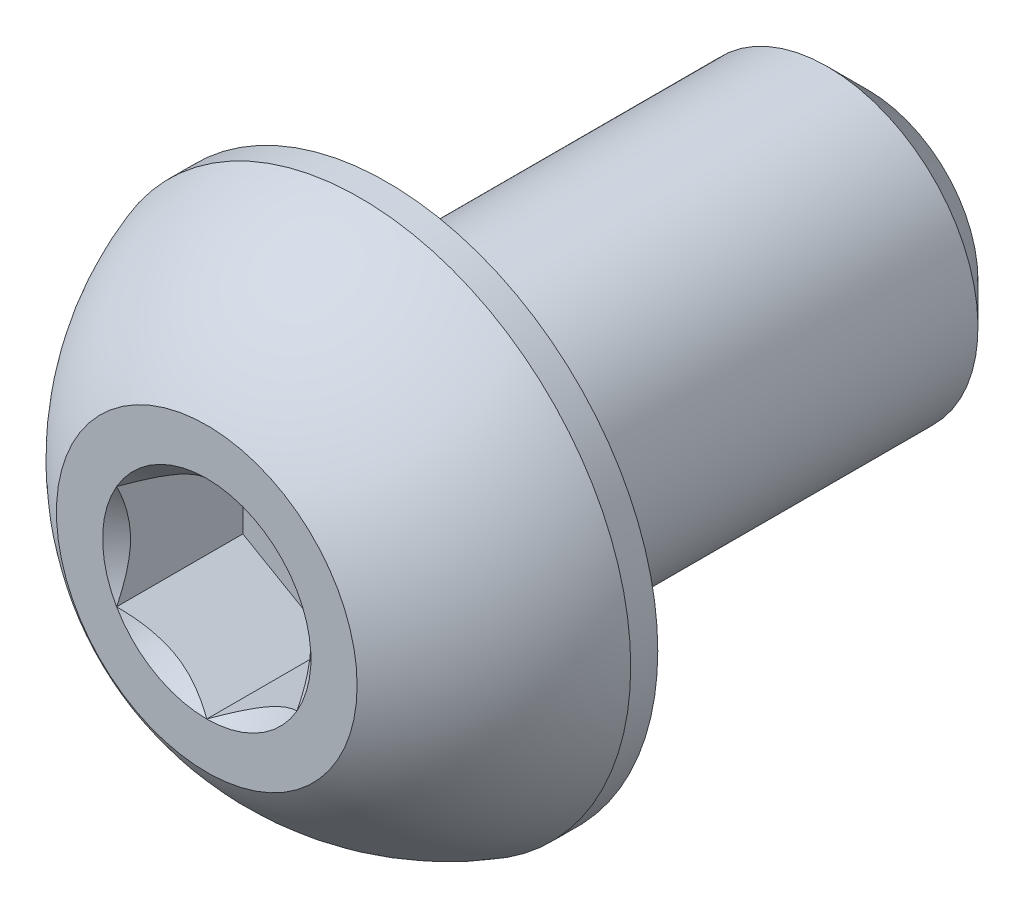
ISO-10303-21;
HEADER;
FILE_DESCRIPTION(('STEP AP214'),'2;1');
FILE_NAME('part.step','',(''),(''),'','','');
FILE_SCHEMA(('AUTOMOTIVE_DESIGN { 1 0 10303 214 1 1 1 1 }'));
ENDSEC;
DATA;
#1=APPLICATION_CONTEXT('core data for automotive mechanical design processes');
#2=APPLICATION_PROTOCOL_DEFINITION('international standard','automotive_design',2000,#1);
#3=PRODUCT_CONTEXT('',#1,'mechanical');
#4=PRODUCT('Part','Part','',(#3));
#5=PRODUCT_RELATED_PRODUCT_CATEGORY('part','',(#4));
#6=PRODUCT_DEFINITION_FORMATION('','',#4);
#7=PRODUCT_DEFINITION_CONTEXT('part definition',#1,'design');
#8=PRODUCT_DEFINITION('design','',#6,#7);
#9=PRODUCT_DEFINITION_SHAPE('','',#8);
#10=(LENGTH_UNIT() NAMED_UNIT(*) SI_UNIT(.MILLI.,.METRE.));
#11=(NAMED_UNIT(*) PLANE_ANGLE_UNIT() SI_UNIT($,.RADIAN.));
#12=(NAMED_UNIT(*) SI_UNIT($,.STERADIAN.) SOLID_ANGLE_UNIT());
#13=UNCERTAINTY_MEASURE_WITH_UNIT(LENGTH_MEASURE(1.E-05),#10,'distance_accuracy_value','');
#14=(GEOMETRIC_REPRESENTATION_CONTEXT(3) GLOBAL_UNCERTAINTY_ASSIGNED_CONTEXT((#13)) GLOBAL_UNIT_ASSIGNED_CONTEXT((#10,
#11,#12)) REPRESENTATION_CONTEXT('',''));
#15=CARTESIAN_POINT('',(0.,0.,0.));
#16=DIRECTION('',(0.,0.,1.));
#17=DIRECTION('',(1.,0.,0.));
#18=AXIS2_PLACEMENT_3D('',#15,#16,#17);
#19=CARTESIAN_POINT('',(0.,-0.866025403784439,-1.05));
#20=DIRECTION('',(0.5,-0.866025403784438,0.));
#21=DIRECTION('',(0.,0.,-1.));
#22=AXIS2_PLACEMENT_3D('',#19,#20,#21);
#23=PLANE('',#22);
#24=DIRECTION('',(0.,0.,1.));
#25=VECTOR('',#24,1.);
#26=CARTESIAN_POINT('',(0.,-0.866025403784439,-1.05));
#27=LINE('',#26,#25);
#28=CARTESIAN_POINT('',(0.,-0.866025403784439,-1.05));
#29=VERTEX_POINT('',#28);
#30=CARTESIAN_POINT('',(0.,-0.866025403784439,0.));
#31=VERTEX_POINT('',#30);
#32=EDGE_CURVE('E11',#29,#31,#27,.T.);
#33=ORIENTED_EDGE('',*,*,#32,.T.);
#34=CARTESIAN_POINT('',(0.,-0.866025403784439,0.));
#35=CARTESIAN_POINT('',(0.198953680178937,-0.751159442976863,-0.114865960807574));
#36=CARTESIAN_POINT('',(0.373617467333079,-0.65031725844574,-0.116023704767206));
#37=CARTESIAN_POINT('',(0.547049913819154,-0.550185988780789,-0.117173286890638));
#38=CARTESIAN_POINT('',(0.75,-0.43301270189222,0.));
#39=B_SPLINE_CURVE_WITH_KNOTS('',2,(#34,#35,#36,#37,#38),.UNSPECIFIED.,.F.,.F.,(3,2,3),(0.,0.5,
1.),.UNSPECIFIED.);
#40=CARTESIAN_POINT('',(0.75,-0.43301270189222,0.));
#41=VERTEX_POINT('',#40);
#42=EDGE_CURVE('E379',#31,#41,#39,.T.);
#43=ORIENTED_EDGE('',*,*,#42,.T.);
#44=DIRECTION('',(0.,0.,1.));
#45=VECTOR('',#44,1.);
#46=CARTESIAN_POINT('',(0.75,-0.433012701892219,-1.05));
#47=LINE('',#46,#45);
#48=CARTESIAN_POINT('',(0.75,-0.433012701892219,-1.05));
#49=VERTEX_POINT('',#48);
#50=EDGE_CURVE('E226',#49,#41,#47,.T.);
#51=ORIENTED_EDGE('',*,*,#50,.F.);
#52=DIRECTION('',(0.866025403784438,0.5,0.));
#53=VECTOR('',#52,1.);
#54=CARTESIAN_POINT('',(0.,-0.866025403784439,-1.05));
#55=LINE('',#54,#53);
#56=EDGE_CURVE('E382',#29,#49,#55,.T.);
#57=ORIENTED_EDGE('',*,*,#56,.F.);
#58=EDGE_LOOP('',(#33,#43,#51,#57));
#59=FACE_BOUND('',#58,.T.);
#60=ADVANCED_FACE('F16',(#59),#23,.F.);
#61=CARTESIAN_POINT('',(-0.75,-0.43301270189222,-1.05));
#62=DIRECTION('',(-0.5,-0.866025403784439,0.));
#63=DIRECTION('',(-0.866025403784439,0.5,0.));
#64=AXIS2_PLACEMENT_3D('',#61,#62,#63);
#65=PLANE('',#64);
#66=DIRECTION('',(0.,0.,1.));
#67=VECTOR('',#66,1.);
#68=CARTESIAN_POINT('',(-0.75,-0.43301270189222,-1.05));
#69=LINE('',#68,#67);
#70=CARTESIAN_POINT('',(-0.75,-0.43301270189222,-1.05));
#71=VERTEX_POINT('',#70);
#72=CARTESIAN_POINT('',(-0.75,-0.43301270189222,0.));
#73=VERTEX_POINT('',#72);
#74=EDGE_CURVE('E30',#71,#73,#69,.T.);
#75=ORIENTED_EDGE('',*,*,#74,.T.);
#76=CARTESIAN_POINT('',(-0.75,-0.43301270189222,0.));
#77=CARTESIAN_POINT('',(-0.551046319821072,-0.54787866269979,-0.11486596080757));
#78=CARTESIAN_POINT('',(-0.376382532666921,-0.648720847230919,-0.116023704767205));
#79=CARTESIAN_POINT('',(-0.202950086180853,-0.748852116895866,-0.117173286890641));
#80=CARTESIAN_POINT('',(0.,-0.866025403784439,0.));
#81=B_SPLINE_CURVE_WITH_KNOTS('',2,(#76,#77,#78,#79,#80),.UNSPECIFIED.,.F.,.F.,(3,2,3),(0.,0.5,
1.),.UNSPECIFIED.);
#82=EDGE_CURVE('E134',#73,#31,#81,.T.);
#83=ORIENTED_EDGE('',*,*,#82,.T.);
#84=ORIENTED_EDGE('',*,*,#32,.F.);
#85=DIRECTION('',(0.866025403784439,-0.5,0.));
#86=VECTOR('',#85,1.);
#87=CARTESIAN_POINT('',(-0.75,-0.43301270189222,-1.05));
#88=LINE('',#87,#86);
#89=EDGE_CURVE('E330',#71,#29,#88,.T.);
#90=ORIENTED_EDGE('',*,*,#89,.F.);
#91=EDGE_LOOP('',(#75,#83,#84,#90));
#92=FACE_BOUND('',#91,.T.);
#93=ADVANCED_FACE('F303',(#92),#65,.F.);
#94=CARTESIAN_POINT('',(-0.75,0.433012701892219,-1.05));
#95=DIRECTION('',(-1.,0.,0.));
#96=DIRECTION('',(0.,0.,1.));
#97=AXIS2_PLACEMENT_3D('',#94,#95,#96);
#98=PLANE('',#97);
#99=DIRECTION('',(0.,0.,1.));
#100=VECTOR('',#99,1.);
#101=CARTESIAN_POINT('',(-0.75,0.433012701892219,-1.05));
#102=LINE('',#101,#100);
#103=CARTESIAN_POINT('',(-0.75,0.433012701892219,-1.05));
#104=VERTEX_POINT('',#103);
#105=CARTESIAN_POINT('',(-0.75,0.433012701892219,0.));
#106=VERTEX_POINT('',#105);
#107=EDGE_CURVE('E113',#104,#106,#102,.T.);
#108=ORIENTED_EDGE('',*,*,#107,.T.);
#109=CARTESIAN_POINT('',(-0.75,0.433012701892219,0.));
#110=CARTESIAN_POINT('',(-0.75,0.202467853991345,-0.115272423950437));
#111=CARTESIAN_POINT('',(-0.75,4.72106457010584E-05,-0.116025402298541));
#112=CARTESIAN_POINT('',(-0.75,-0.199477485688016,-0.116767608102101));
#113=CARTESIAN_POINT('',(-0.75,-0.43301270189222,0.));
#114=B_SPLINE_CURVE_WITH_KNOTS('',2,(#109,#110,#111,#112,#113),.UNSPECIFIED.,.F.,.F.,(3,2,3),
(0.,0.5,1.),.UNSPECIFIED.);
#115=EDGE_CURVE('E115',#106,#73,#114,.T.);
#116=ORIENTED_EDGE('',*,*,#115,.T.);
#117=ORIENTED_EDGE('',*,*,#74,.F.);
#118=DIRECTION('',(0.,-1.,0.));
#119=VECTOR('',#118,1.);
#120=CARTESIAN_POINT('',(-0.75,0.433012701892219,-1.05));
#121=LINE('',#120,#119);
#122=EDGE_CURVE('E119',#104,#71,#121,.T.);
#123=ORIENTED_EDGE('',*,*,#122,.F.);
#124=EDGE_LOOP('',(#108,#116,#117,#123));
#125=FACE_BOUND('',#124,.T.);
#126=ADVANCED_FACE('F18',(#125),#98,.F.);
#127=CARTESIAN_POINT('',(0.,0.866025403784439,-1.05));
#128=DIRECTION('',(-0.5,0.866025403784439,0.));
#129=DIRECTION('',(0.,0.,1.));
#130=AXIS2_PLACEMENT_3D('',#127,#128,#129);
#131=PLANE('',#130);
#132=DIRECTION('',(0.,0.,1.));
#133=VECTOR('',#132,1.);
#134=CARTESIAN_POINT('',(0.,0.866025403784439,-1.05));
#135=LINE('',#134,#133);
#136=CARTESIAN_POINT('',(0.,0.866025403784439,-1.05));
#137=VERTEX_POINT('',#136);
#138=CARTESIAN_POINT('',(0.,0.866025403784439,0.));
#139=VERTEX_POINT('',#138);
#140=EDGE_CURVE('E125',#137,#139,#135,.T.);
#141=ORIENTED_EDGE('',*,*,#140,.T.);
#142=CARTESIAN_POINT('',(0.,0.866025403784439,0.));
#143=CARTESIAN_POINT('',(-0.198953680178928,0.751159442976868,-0.11486596080757));
#144=CARTESIAN_POINT('',(-0.37361746733308,0.65031725844574,-0.116023704767206));
#145=CARTESIAN_POINT('',(-0.547049913819147,0.550185988780793,-0.117173286890642));
#146=CARTESIAN_POINT('',(-0.750000000000001,0.43301270189222,0.));
#147=B_SPLINE_CURVE_WITH_KNOTS('',2,(#142,#143,#144,#145,#146),.UNSPECIFIED.,.F.,.F.,(3,2,3),
(0.,0.5,1.),.UNSPECIFIED.);
#148=EDGE_CURVE('E135',#139,#106,#147,.T.);
#149=ORIENTED_EDGE('',*,*,#148,.T.);
#150=ORIENTED_EDGE('',*,*,#107,.F.);
#151=DIRECTION('',(-0.866025403784439,-0.5,0.));
#152=VECTOR('',#151,1.);
#153=CARTESIAN_POINT('',(0.,0.866025403784439,-1.05));
#154=LINE('',#153,#152);
#155=EDGE_CURVE('E460',#137,#104,#154,.T.);
#156=ORIENTED_EDGE('',*,*,#155,.F.);
#157=EDGE_LOOP('',(#141,#149,#150,#156));
#158=FACE_BOUND('',#157,.T.);
#159=ADVANCED_FACE('F141',(#158),#131,.F.);
#160=CARTESIAN_POINT('',(0.75,0.43301270189222,-1.05));
#161=DIRECTION('',(0.5,0.866025403784439,0.));
#162=DIRECTION('',(0.,0.,-1.));
#163=AXIS2_PLACEMENT_3D('',#160,#161,#162);
#164=PLANE('',#163);
#165=DIRECTION('',(0.,0.,1.));
#166=VECTOR('',#165,1.);
#167=CARTESIAN_POINT('',(0.75,0.43301270189222,-1.05));
#168=LINE('',#167,#166);
#169=CARTESIAN_POINT('',(0.75,0.43301270189222,-1.05));
#170=VERTEX_POINT('',#169);
#171=CARTESIAN_POINT('',(0.75,0.43301270189222,0.));
#172=VERTEX_POINT('',#171);
#173=EDGE_CURVE('E218',#170,#172,#168,.T.);
#174=ORIENTED_EDGE('',*,*,#173,.T.);
#175=CARTESIAN_POINT('',(0.75,0.43301270189222,0.));
#176=CARTESIAN_POINT('',(0.551046319821072,0.54787866269979,-0.11486596080757));
#177=CARTESIAN_POINT('',(0.376382532666921,0.648720847230919,-0.116023704767206));
#178=CARTESIAN_POINT('',(0.202950086180853,0.748852116895866,-0.117173286890642));
#179=CARTESIAN_POINT('',(0.,0.866025403784439,0.));
#180=B_SPLINE_CURVE_WITH_KNOTS('',2,(#175,#176,#177,#178,#179),.UNSPECIFIED.,.F.,.F.,(3,2,3),
(0.,0.5,1.),.UNSPECIFIED.);
#181=EDGE_CURVE('E146',#172,#139,#180,.T.);
#182=ORIENTED_EDGE('',*,*,#181,.T.);
#183=ORIENTED_EDGE('',*,*,#140,.F.);
#184=DIRECTION('',(-0.866025403784439,0.5,0.));
#185=VECTOR('',#184,1.);
#186=CARTESIAN_POINT('',(0.75,0.43301270189222,-1.05));
#187=LINE('',#186,#185);
#188=EDGE_CURVE('E472',#170,#137,#187,.T.);
#189=ORIENTED_EDGE('',*,*,#188,.F.);
#190=EDGE_LOOP('',(#174,#182,#183,#189));
#191=FACE_BOUND('',#190,.T.);
#192=ADVANCED_FACE('F247',(#191),#164,.F.);
#193=CARTESIAN_POINT('',(0.75,-0.433012701892219,-1.05));
#194=DIRECTION('',(1.,0.,0.));
#195=DIRECTION('',(0.,1.,0.));
#196=AXIS2_PLACEMENT_3D('',#193,#194,#195);
#197=PLANE('',#196);
#198=ORIENTED_EDGE('',*,*,#50,.T.);
#199=CARTESIAN_POINT('',(0.75,-0.433012701892219,0.));
#200=CARTESIAN_POINT('',(0.75,-0.20241534600529,-0.115298677943464));
#201=CARTESIAN_POINT('',(0.75,4.721064570198E-05,-0.116025402298541));
#202=CARTESIAN_POINT('',(0.75,0.199529841034302,-0.116741430428958));
#203=CARTESIAN_POINT('',(0.75,0.43301270189222,0.));
#204=B_SPLINE_CURVE_WITH_KNOTS('',2,(#199,#200,#201,#202,#203),.UNSPECIFIED.,.F.,.F.,(3,2,3),
(0.,0.5,1.),.UNSPECIFIED.);
#205=EDGE_CURVE('E233',#41,#172,#204,.T.);
#206=ORIENTED_EDGE('',*,*,#205,.T.);
#207=ORIENTED_EDGE('',*,*,#173,.F.);
#208=DIRECTION('',(0.,1.,0.));
#209=VECTOR('',#208,1.);
#210=CARTESIAN_POINT('',(0.75,-0.433012701892219,-1.05));
#211=LINE('',#210,#209);
#212=EDGE_CURVE('E391',#49,#170,#211,.T.);
#213=ORIENTED_EDGE('',*,*,#212,.F.);
#214=EDGE_LOOP('',(#198,#206,#207,#213));
#215=FACE_BOUND('',#214,.T.);
#216=ADVANCED_FACE('F237',(#215),#197,.F.);
#217=CARTESIAN_POINT('',(0.75,-0.433012701892219,-1.05));
#218=DIRECTION('',(0.,0.,1.));
#219=DIRECTION('',(1.,0.,0.));
#220=AXIS2_PLACEMENT_3D('',#217,#218,#219);
#221=PLANE('',#220);
#222=ORIENTED_EDGE('',*,*,#56,.T.);
#223=ORIENTED_EDGE('',*,*,#212,.T.);
#224=ORIENTED_EDGE('',*,*,#188,.T.);
#225=ORIENTED_EDGE('',*,*,#155,.T.);
#226=ORIENTED_EDGE('',*,*,#122,.T.);
#227=ORIENTED_EDGE('',*,*,#89,.T.);
#228=EDGE_LOOP('',(#222,#223,#224,#225,#226,#227));
#229=FACE_BOUND('',#228,.T.);
#230=ADVANCED_FACE('F246',(#229),#221,.T.);
#231=CARTESIAN_POINT('',(0.,0.,0.));
#232=DIRECTION('',(0.,0.,1.));
#233=DIRECTION('',(1.,0.,0.));
#234=AXIS2_PLACEMENT_3D('',#231,#232,#233);
#235=CONICAL_SURFACE('',#234,0.866025403784439,0.78539816339745);
#236=CARTESIAN_POINT('',(0.,0.,0.));
#237=DIRECTION('',(0.,0.,1.));
#238=DIRECTION('',(1.,0.,0.));
#239=AXIS2_PLACEMENT_3D('',#236,#237,#238);
#240=CIRCLE('',#239,0.866025403784439);
#241=EDGE_CURVE('E325',#31,#41,#240,.T.);
#242=ORIENTED_EDGE('',*,*,#241,.T.);
#243=ORIENTED_EDGE('',*,*,#42,.F.);
#244=EDGE_LOOP('',(#242,#243));
#245=FACE_BOUND('',#244,.T.);
#246=ADVANCED_FACE('F200',(#245),#235,.F.);
#247=CARTESIAN_POINT('',(0.,0.,0.));
#248=DIRECTION('',(0.,0.,1.));
#249=DIRECTION('',(1.,0.,0.));
#250=AXIS2_PLACEMENT_3D('',#247,#248,#249);
#251=CONICAL_SURFACE('',#250,0.866025403784439,0.78539816339745);
#252=CARTESIAN_POINT('',(0.,0.,0.));
#253=DIRECTION('',(0.,0.,1.));
#254=DIRECTION('',(1.,0.,0.));
#255=AXIS2_PLACEMENT_3D('',#252,#253,#254);
#256=CIRCLE('',#255,0.866025403784439);
#257=EDGE_CURVE('E161',#73,#31,#256,.T.);
#258=ORIENTED_EDGE('',*,*,#257,.T.);
#259=ORIENTED_EDGE('',*,*,#82,.F.);
#260=EDGE_LOOP('',(#258,#259));
#261=FACE_BOUND('',#260,.T.);
#262=ADVANCED_FACE('F190',(#261),#251,.F.);
#263=CARTESIAN_POINT('',(0.,0.,0.));
#264=DIRECTION('',(0.,0.,1.));
#265=DIRECTION('',(1.,0.,0.));
#266=AXIS2_PLACEMENT_3D('',#263,#264,#265);
#267=CONICAL_SURFACE('',#266,0.866025403784439,0.78539816339745);
#268=CARTESIAN_POINT('',(0.,0.,0.));
#269=DIRECTION('',(0.,0.,1.));
#270=DIRECTION('',(1.,0.,0.));
#271=AXIS2_PLACEMENT_3D('',#268,#269,#270);
#272=CIRCLE('',#271,0.866025403784439);
#273=EDGE_CURVE('E132',#106,#73,#272,.T.);
#274=ORIENTED_EDGE('',*,*,#273,.T.);
#275=ORIENTED_EDGE('',*,*,#115,.F.);
#276=EDGE_LOOP('',(#274,#275));
#277=FACE_BOUND('',#276,.T.);
#278=ADVANCED_FACE('F130',(#277),#267,.F.);
#279=CARTESIAN_POINT('',(0.,0.,0.));
#280=DIRECTION('',(0.,0.,1.));
#281=DIRECTION('',(1.,0.,0.));
#282=AXIS2_PLACEMENT_3D('',#279,#280,#281);
#283=CONICAL_SURFACE('',#282,0.866025403784439,0.78539816339745);
#284=CARTESIAN_POINT('',(0.,0.,0.));
#285=DIRECTION('',(0.,0.,1.));
#286=DIRECTION('',(1.,0.,0.));
#287=AXIS2_PLACEMENT_3D('',#284,#285,#286);
#288=CIRCLE('',#287,0.866025403784439);
#289=EDGE_CURVE('E150',#139,#106,#288,.T.);
#290=ORIENTED_EDGE('',*,*,#289,.T.);
#291=ORIENTED_EDGE('',*,*,#148,.F.);
#292=EDGE_LOOP('',(#290,#291));
#293=FACE_BOUND('',#292,.T.);
#294=ADVANCED_FACE('F151',(#293),#283,.F.);
#295=CARTESIAN_POINT('',(0.,0.,0.));
#296=DIRECTION('',(0.,0.,1.));
#297=DIRECTION('',(1.,0.,0.));
#298=AXIS2_PLACEMENT_3D('',#295,#296,#297);
#299=CONICAL_SURFACE('',#298,0.866025403784439,0.78539816339745);
#300=CARTESIAN_POINT('',(0.,0.,0.));
#301=DIRECTION('',(0.,0.,1.));
#302=DIRECTION('',(1.,0.,0.));
#303=AXIS2_PLACEMENT_3D('',#300,#301,#302);
#304=CIRCLE('',#303,0.866025403784439);
#305=EDGE_CURVE('E155',#172,#139,#304,.T.);
#306=ORIENTED_EDGE('',*,*,#305,.T.);
#307=ORIENTED_EDGE('',*,*,#181,.F.);
#308=EDGE_LOOP('',(#306,#307));
#309=FACE_BOUND('',#308,.T.);
#310=ADVANCED_FACE('F204',(#309),#299,.F.);
#311=CARTESIAN_POINT('',(0.,0.,0.));
#312=DIRECTION('',(0.,0.,1.));
#313=DIRECTION('',(1.,0.,0.));
#314=AXIS2_PLACEMENT_3D('',#311,#312,#313);
#315=CONICAL_SURFACE('',#314,0.866025403784439,0.78539816339745);
#316=CARTESIAN_POINT('',(0.,0.,0.));
#317=DIRECTION('',(0.,0.,1.));
#318=DIRECTION('',(1.,0.,0.));
#319=AXIS2_PLACEMENT_3D('',#316,#317,#318);
#320=CIRCLE('',#319,0.866025403784439);
#321=EDGE_CURVE('E285',#41,#172,#320,.T.);
#322=ORIENTED_EDGE('',*,*,#321,.T.);
#323=ORIENTED_EDGE('',*,*,#205,.F.);
#324=EDGE_LOOP('',(#322,#323));
#325=FACE_BOUND('',#324,.T.);
#326=ADVANCED_FACE('F208',(#325),#315,.F.);
#327=CARTESIAN_POINT('',(0.,0.,0.));
#328=DIRECTION('',(0.,0.,1.));
#329=DIRECTION('',(1.,0.,0.));
#330=AXIS2_PLACEMENT_3D('',#327,#328,#329);
#331=CYLINDRICAL_SURFACE('',#330,2.25);
#332=CARTESIAN_POINT('',(0.,0.,-1.275));
#333=DIRECTION('',(0.,0.,1.));
#334=DIRECTION('',(1.,0.,0.));
#335=AXIS2_PLACEMENT_3D('',#332,#333,#334);
#336=CIRCLE('',#335,2.25);
#337=CARTESIAN_POINT('',(2.25,0.,-1.275));
#338=VERTEX_POINT('',#337);
#339=EDGE_CURVE('E84',#338,#338,#336,.T.);
#340=ORIENTED_EDGE('',*,*,#339,.F.);
#341=EDGE_LOOP('',(#340));
#342=FACE_BOUND('',#341,.T.);
#343=CARTESIAN_POINT('',(0.,0.,-1.5));
#344=DIRECTION('',(0.,0.,1.));
#345=DIRECTION('',(1.,0.,0.));
#346=AXIS2_PLACEMENT_3D('',#343,#344,#345);
#347=CIRCLE('',#346,2.25);
#348=CARTESIAN_POINT('',(2.25,0.,-1.5));
#349=VERTEX_POINT('',#348);
#350=EDGE_CURVE('E340',#349,#349,#347,.T.);
#351=ORIENTED_EDGE('',*,*,#350,.T.);
#352=EDGE_LOOP('',(#351));
#353=FACE_BOUND('',#352,.T.);
#354=ADVANCED_FACE('F263',(#342,#353),#331,.T.);
#355=CARTESIAN_POINT('',(0.,-2.25,-1.5));
#356=DIRECTION('',(0.,0.,1.));
#357=DIRECTION('',(1.,0.,0.));
#358=AXIS2_PLACEMENT_3D('',#355,#356,#357);
#359=PLANE('',#358);
#360=CARTESIAN_POINT('',(0.,0.,-1.5));
#361=DIRECTION('',(0.,0.,-1.));
#362=DIRECTION('',(1.,0.,0.));
#363=AXIS2_PLACEMENT_3D('',#360,#361,#362);
#364=CIRCLE('',#363,1.25);
#365=CARTESIAN_POINT('',(1.25,0.,-1.5));
#366=VERTEX_POINT('',#365);
#367=EDGE_CURVE('E524',#366,#366,#364,.T.);
#368=ORIENTED_EDGE('',*,*,#367,.F.);
#369=EDGE_LOOP('',(#368));
#370=FACE_BOUND('',#369,.T.);
#371=ORIENTED_EDGE('',*,*,#350,.F.);
#372=EDGE_LOOP('',(#371));
#373=FACE_BOUND('',#372,.T.);
#374=ADVANCED_FACE('F251',(#370,#373),#359,.F.);
#375=CARTESIAN_POINT('',(0.,-1.25,0.));
#376=DIRECTION('',(0.,0.,-1.));
#377=DIRECTION('',(0.,-1.,0.));
#378=AXIS2_PLACEMENT_3D('',#375,#376,#377);
#379=PLANE('',#378);
#380=ORIENTED_EDGE('',*,*,#273,.F.);
#381=ORIENTED_EDGE('',*,*,#289,.F.);
#382=ORIENTED_EDGE('',*,*,#305,.F.);
#383=ORIENTED_EDGE('',*,*,#321,.F.);
#384=ORIENTED_EDGE('',*,*,#241,.F.);
#385=ORIENTED_EDGE('',*,*,#257,.F.);
#386=EDGE_LOOP('',(#380,#381,#382,#383,#384,#385));
#387=FACE_BOUND('',#386,.T.);
#388=CARTESIAN_POINT('',(0.,0.,0.));
#389=DIRECTION('',(0.,0.,1.));
#390=DIRECTION('',(1.,0.,0.));
#391=AXIS2_PLACEMENT_3D('',#388,#389,#390);
#392=CIRCLE('',#391,1.25);
#393=CARTESIAN_POINT('',(1.25,0.,0.));
#394=VERTEX_POINT('',#393);
#395=EDGE_CURVE('E163',#394,#394,#392,.T.);
#396=ORIENTED_EDGE('',*,*,#395,.T.);
#397=EDGE_LOOP('',(#396));
#398=FACE_BOUND('',#397,.T.);
#399=ADVANCED_FACE('F157',(#387,#398),#379,.F.);
#400=CARTESIAN_POINT('',(0.,0.,-2.01004901960784));
#401=DIRECTION('',(1.,0.,0.));
#402=DIRECTION('',(0.,-1.,0.));
#403=AXIS2_PLACEMENT_3D('',#400,#401,#402);
#404=SPHERICAL_SURFACE('',#403,2.36702282651149);
#405=CARTESIAN_POINT('',(0.,0.,-2.01004901960784));
#406=DIRECTION('',(0.,0.,1.));
#407=DIRECTION('',(1.,0.,0.));
#408=AXIS2_PLACEMENT_3D('',#405,#406,#407);
#409=SPHERICAL_SURFACE('',#408,2.36702282651149);
#410=ORIENTED_EDGE('',*,*,#395,.F.);
#411=EDGE_LOOP('',(#410));
#412=FACE_BOUND('',#411,.T.);
#413=ORIENTED_EDGE('',*,*,#339,.T.);
#414=EDGE_LOOP('',(#413));
#415=FACE_BOUND('',#414,.T.);
#416=ADVANCED_FACE('F360',(#412,#415),#409,.T.);
#417=CARTESIAN_POINT('',(0.,0.,-5.5));
#418=DIRECTION('',(0.,0.,1.));
#419=DIRECTION('',(0.,-1.,0.));
#420=AXIS2_PLACEMENT_3D('',#417,#418,#419);
#421=CONICAL_SURFACE('',#420,0.9125,0.785398163397445);
#422=CARTESIAN_POINT('',(0.,0.,-5.5));
#423=DIRECTION('',(0.,0.,-1.));
#424=DIRECTION('',(0.,1.,0.));
#425=AXIS2_PLACEMENT_3D('',#422,#423,#424);
#426=CIRCLE('',#425,0.9125);
#427=CARTESIAN_POINT('',(0.,0.9125,-5.5));
#428=VERTEX_POINT('',#427);
#429=EDGE_CURVE('E527',#428,#428,#426,.T.);
#430=ORIENTED_EDGE('',*,*,#429,.F.);
#431=EDGE_LOOP('',(#430));
#432=FACE_BOUND('',#431,.T.);
#433=CARTESIAN_POINT('',(0.,0.,-5.1625));
#434=DIRECTION('',(0.,0.,1.));
#435=DIRECTION('',(0.,1.,0.));
#436=AXIS2_PLACEMENT_3D('',#433,#434,#435);
#437=CIRCLE('',#436,1.25);
#438=CARTESIAN_POINT('',(0.,1.25,-5.1625));
#439=VERTEX_POINT('',#438);
#440=EDGE_CURVE('E94',#439,#439,#437,.T.);
#441=ORIENTED_EDGE('',*,*,#440,.F.);
#442=EDGE_LOOP('',(#441));
#443=FACE_BOUND('',#442,.T.);
#444=ADVANCED_FACE('F357',(#432,#443),#421,.T.);
#445=CARTESIAN_POINT('',(0.,0.,-5.5));
#446=DIRECTION('',(0.,0.,-1.));
#447=DIRECTION('',(0.,1.,0.));
#448=AXIS2_PLACEMENT_3D('',#445,#446,#447);
#449=CYLINDRICAL_SURFACE('',#448,1.25);
#450=ORIENTED_EDGE('',*,*,#440,.T.);
#451=EDGE_LOOP('',(#450));
#452=FACE_BOUND('',#451,.T.);
#453=ORIENTED_EDGE('',*,*,#367,.T.);
#454=EDGE_LOOP('',(#453));
#455=FACE_BOUND('',#454,.T.);
#456=ADVANCED_FACE('F202',(#452,#455),#449,.T.);
#457=CARTESIAN_POINT('',(0.,-1.25,-5.5));
#458=DIRECTION('',(0.,0.,-1.));
#459=DIRECTION('',(0.,-1.,0.));
#460=AXIS2_PLACEMENT_3D('',#457,#458,#459);
#461=PLANE('',#460);
#462=ORIENTED_EDGE('',*,*,#429,.T.);
#463=EDGE_LOOP('',(#462));
#464=FACE_BOUND('',#463,.T.);
#465=ADVANCED_FACE('F362',(#464),#461,.T.);
#466=CLOSED_SHELL('',(#60,#93,#126,#159,#192,#216,#230,#246,#262,#278,#294,#310,#326,#354,#374,
#399,#416,#444,#456,#465));
#467=MANIFOLD_SOLID_BREP('B1',#466);
#468=ADVANCED_BREP_SHAPE_REPRESENTATION('',(#18,#467),#14);
#469=SHAPE_DEFINITION_REPRESENTATION(#9,#468);
ENDSEC;
END-ISO-10303-21;
